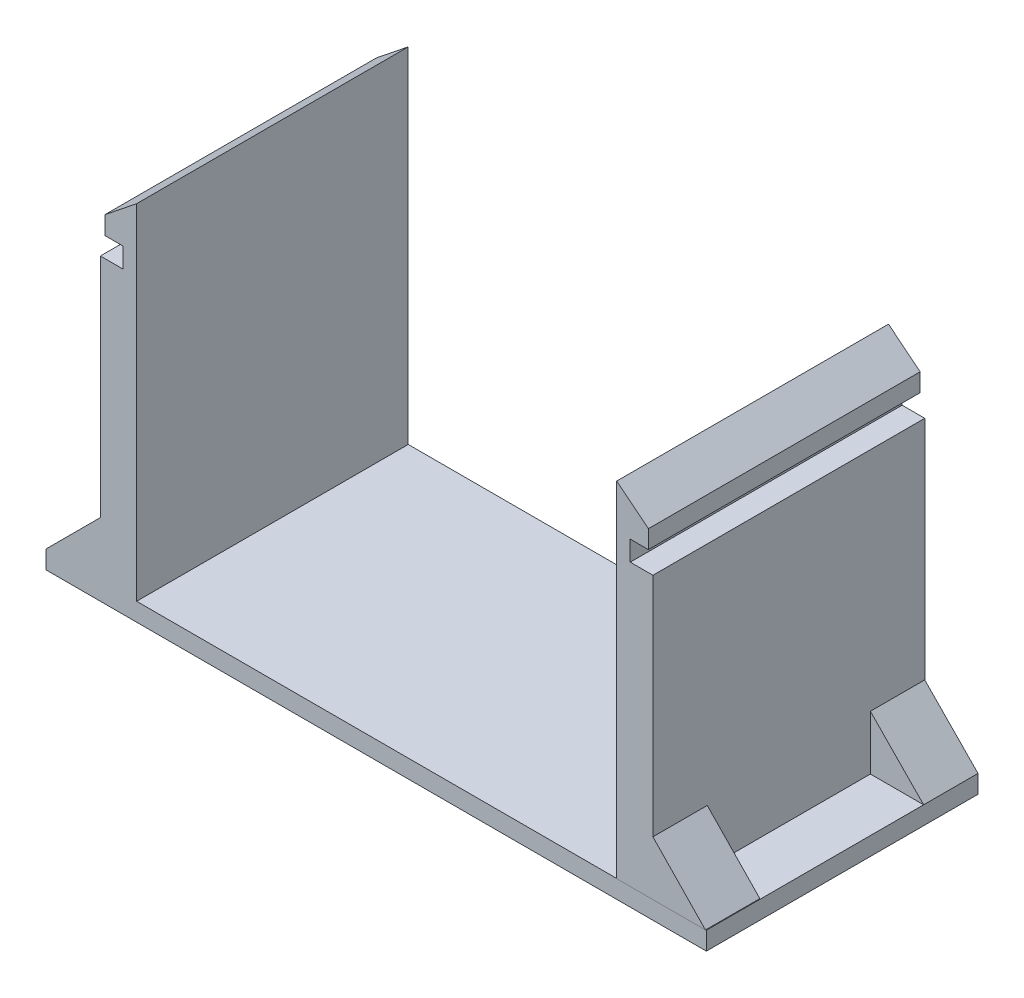
ISO-10303-21;
HEADER;
FILE_DESCRIPTION(('STEP AP214'),'2;1');
FILE_NAME('part.step','',(''),(''),'','','');
FILE_SCHEMA(('AUTOMOTIVE_DESIGN { 1 0 10303 214 1 1 1 1 }'));
ENDSEC;
DATA;
#1=APPLICATION_CONTEXT('core data for automotive mechanical design processes');
#2=APPLICATION_PROTOCOL_DEFINITION('international standard','automotive_design',2000,#1);
#3=PRODUCT_CONTEXT('',#1,'mechanical');
#4=PRODUCT('Part','Part','',(#3));
#5=PRODUCT_RELATED_PRODUCT_CATEGORY('part','',(#4));
#6=PRODUCT_DEFINITION_FORMATION('','',#4);
#7=PRODUCT_DEFINITION_CONTEXT('part definition',#1,'design');
#8=PRODUCT_DEFINITION('design','',#6,#7);
#9=PRODUCT_DEFINITION_SHAPE('','',#8);
#10=(LENGTH_UNIT() NAMED_UNIT(*) SI_UNIT(.MILLI.,.METRE.));
#11=(NAMED_UNIT(*) PLANE_ANGLE_UNIT() SI_UNIT($,.RADIAN.));
#12=(NAMED_UNIT(*) SI_UNIT($,.STERADIAN.) SOLID_ANGLE_UNIT());
#13=UNCERTAINTY_MEASURE_WITH_UNIT(LENGTH_MEASURE(1.E-05),#10,'distance_accuracy_value','');
#14=(GEOMETRIC_REPRESENTATION_CONTEXT(3) GLOBAL_UNCERTAINTY_ASSIGNED_CONTEXT((#13)) GLOBAL_UNIT_ASSIGNED_CONTEXT((#10,
#11,#12)) REPRESENTATION_CONTEXT('',''));
#15=CARTESIAN_POINT('',(0.,0.,0.));
#16=DIRECTION('',(0.,0.,1.));
#17=DIRECTION('',(1.,0.,0.));
#18=AXIS2_PLACEMENT_3D('',#15,#16,#17);
#19=CARTESIAN_POINT('',(0.,0.,0.));
#20=DIRECTION('',(0.,1.,0.));
#21=DIRECTION('',(0.,0.,1.));
#22=AXIS2_PLACEMENT_3D('',#19,#20,#21);
#23=PLANE('',#22);
#24=DIRECTION('',(0.,0.,1.));
#25=VECTOR('',#24,1.);
#26=CARTESIAN_POINT('',(-24.1176439430055,0.,0.));
#27=LINE('',#26,#25);
#28=CARTESIAN_POINT('',(-24.1176439430055,0.,-5.93114042057311));
#29=VERTEX_POINT('',#28);
#30=CARTESIAN_POINT('',(-24.1176439430055,0.,12.0443693212289));
#31=VERTEX_POINT('',#30);
#32=EDGE_CURVE('E393',#29,#31,#27,.T.);
#33=ORIENTED_EDGE('',*,*,#32,.F.);
#34=DIRECTION('',(-1.,0.,0.));
#35=VECTOR('',#34,1.);
#36=CARTESIAN_POINT('',(-24.1176439430055,0.,-5.93114042057311));
#37=LINE('',#36,#35);
#38=CARTESIAN_POINT('',(-30.1176439430055,0.,-5.93114042057311));
#39=VERTEX_POINT('',#38);
#40=EDGE_CURVE('E282',#29,#39,#37,.T.);
#41=ORIENTED_EDGE('',*,*,#40,.T.);
#42=DIRECTION('',(0.,0.,1.));
#43=VECTOR('',#42,1.);
#44=CARTESIAN_POINT('',(-30.1176439430055,0.,18.0443693212289));
#45=LINE('',#44,#43);
#46=CARTESIAN_POINT('',(-30.1176439430055,0.,12.0443693212289));
#47=VERTEX_POINT('',#46);
#48=EDGE_CURVE('E486',#39,#47,#45,.T.);
#49=ORIENTED_EDGE('',*,*,#48,.T.);
#50=DIRECTION('',(1.,0.,0.));
#51=VECTOR('',#50,1.);
#52=CARTESIAN_POINT('',(-30.1176439430055,0.,12.0443693212289));
#53=LINE('',#52,#51);
#54=EDGE_CURVE('E296',#47,#31,#53,.T.);
#55=ORIENTED_EDGE('',*,*,#54,.T.);
#56=EDGE_LOOP('',(#33,#41,#49,#55));
#57=FACE_BOUND('',#56,.T.);
#58=ADVANCED_FACE('F37',(#57),#23,.T.);
#59=DIRECTION('',(0.,0.,-1.));
#60=VECTOR('',#59,1.);
#61=CARTESIAN_POINT('',(42.7586957286419,0.,18.0443693212289));
#62=LINE('',#61,#60);
#63=CARTESIAN_POINT('',(42.7586957286419,0.,18.0443693212289));
#64=VERTEX_POINT('',#63);
#65=CARTESIAN_POINT('',(42.7586957286419,0.,-5.93114042057311));
#66=VERTEX_POINT('',#65);
#67=EDGE_CURVE('E378',#64,#66,#62,.T.);
#68=ORIENTED_EDGE('',*,*,#67,.T.);
#69=DIRECTION('',(-1.,0.,0.));
#70=VECTOR('',#69,1.);
#71=CARTESIAN_POINT('',(36.8823560569945,0.,-5.93114042057311));
#72=LINE('',#71,#70);
#73=CARTESIAN_POINT('',(36.8823560569945,0.,-5.93114042057311));
#74=VERTEX_POINT('',#73);
#75=EDGE_CURVE('E308',#66,#74,#72,.T.);
#76=ORIENTED_EDGE('',*,*,#75,.T.);
#77=DIRECTION('',(0.,0.,1.));
#78=VECTOR('',#77,1.);
#79=CARTESIAN_POINT('',(36.8823560569945,0.,0.));
#80=LINE('',#79,#78);
#81=CARTESIAN_POINT('',(36.8823560569945,0.,12.0688595794269));
#82=VERTEX_POINT('',#81);
#83=EDGE_CURVE('E339',#74,#82,#80,.T.);
#84=ORIENTED_EDGE('',*,*,#83,.T.);
#85=DIRECTION('',(1.,0.,0.));
#86=VECTOR('',#85,1.);
#87=CARTESIAN_POINT('',(36.8823560569945,0.,12.0688595794269));
#88=LINE('',#87,#86);
#89=CARTESIAN_POINT('',(42.6823560569945,0.,12.0688595794269));
#90=VERTEX_POINT('',#89);
#91=EDGE_CURVE('E331',#82,#90,#88,.T.);
#92=ORIENTED_EDGE('',*,*,#91,.T.);
#93=DIRECTION('',(0.,0.,1.));
#94=VECTOR('',#93,1.);
#95=CARTESIAN_POINT('',(42.6823560569945,0.,12.0688595794269));
#96=LINE('',#95,#94);
#97=CARTESIAN_POINT('',(42.6823560569945,0.,18.0443693212289));
#98=VERTEX_POINT('',#97);
#99=EDGE_CURVE('E336',#90,#98,#96,.T.);
#100=ORIENTED_EDGE('',*,*,#99,.T.);
#101=DIRECTION('',(1.,0.,0.));
#102=VECTOR('',#101,1.);
#103=CARTESIAN_POINT('',(-30.1176439430055,0.,18.0443693212289));
#104=LINE('',#103,#102);
#105=EDGE_CURVE('E361',#98,#64,#104,.T.);
#106=ORIENTED_EDGE('',*,*,#105,.T.);
#107=EDGE_LOOP('',(#68,#76,#84,#92,#100,#106));
#108=FACE_BOUND('',#107,.T.);
#109=ADVANCED_FACE('F506',(#108),#23,.T.);
#110=CARTESIAN_POINT('',(-20.1176439430055,0.,18.0443693212289));
#111=VERTEX_POINT('',#110);
#112=CARTESIAN_POINT('',(32.8823560569945,0.,18.0443693212289));
#113=VERTEX_POINT('',#112);
#114=EDGE_CURVE('E383',#111,#113,#104,.T.);
#115=ORIENTED_EDGE('',*,*,#114,.T.);
#116=DIRECTION('',(0.,0.,1.));
#117=VECTOR('',#116,1.);
#118=CARTESIAN_POINT('',(32.8823560569945,0.,0.));
#119=LINE('',#118,#117);
#120=CARTESIAN_POINT('',(32.8823560569945,0.,-11.9311404205731));
#121=VERTEX_POINT('',#120);
#122=EDGE_CURVE('E349',#121,#113,#119,.T.);
#123=ORIENTED_EDGE('',*,*,#122,.F.);
#124=DIRECTION('',(-1.,0.,0.));
#125=VECTOR('',#124,1.);
#126=CARTESIAN_POINT('',(-30.1176439430055,0.,-11.9311404205731));
#127=LINE('',#126,#125);
#128=CARTESIAN_POINT('',(-20.1176439430055,0.,-11.9311404205731));
#129=VERTEX_POINT('',#128);
#130=EDGE_CURVE('E390',#121,#129,#127,.T.);
#131=ORIENTED_EDGE('',*,*,#130,.T.);
#132=DIRECTION('',(0.,0.,1.));
#133=VECTOR('',#132,1.);
#134=CARTESIAN_POINT('',(-20.1176439430055,0.,0.));
#135=LINE('',#134,#133);
#136=EDGE_CURVE('E396',#129,#111,#135,.T.);
#137=ORIENTED_EDGE('',*,*,#136,.T.);
#138=EDGE_LOOP('',(#115,#123,#131,#137));
#139=FACE_BOUND('',#138,.T.);
#140=ADVANCED_FACE('F496',(#139),#23,.T.);
#141=CARTESIAN_POINT('',(-24.1176439430055,38.,0.));
#142=DIRECTION('',(1.,0.,0.));
#143=DIRECTION('',(0.,0.,-1.));
#144=AXIS2_PLACEMENT_3D('',#141,#142,#143);
#145=PLANE('',#144);
#146=DIRECTION('',(0.,-1.,0.));
#147=VECTOR('',#146,1.);
#148=CARTESIAN_POINT('',(-24.1176439430055,38.,18.0443693212289));
#149=LINE('',#148,#147);
#150=CARTESIAN_POINT('',(-24.1176439430055,31.,18.0443693212289));
#151=VERTEX_POINT('',#150);
#152=CARTESIAN_POINT('',(-24.1176439430055,6.,18.0443693212289));
#153=VERTEX_POINT('',#152);
#154=EDGE_CURVE('E408',#151,#153,#149,.T.);
#155=ORIENTED_EDGE('',*,*,#154,.F.);
#156=DIRECTION('',(0.,0.,1.));
#157=VECTOR('',#156,1.);
#158=CARTESIAN_POINT('',(-24.1176439430055,31.,18.0443693212289));
#159=LINE('',#158,#157);
#160=CARTESIAN_POINT('',(-24.1176439430055,31.,-11.9311404205731));
#161=VERTEX_POINT('',#160);
#162=EDGE_CURVE('E236',#161,#151,#159,.T.);
#163=ORIENTED_EDGE('',*,*,#162,.F.);
#164=DIRECTION('',(0.,-1.,0.));
#165=VECTOR('',#164,1.);
#166=CARTESIAN_POINT('',(-24.1176439430055,38.,-11.9311404205731));
#167=LINE('',#166,#165);
#168=CARTESIAN_POINT('',(-24.1176439430055,6.,-11.9311404205731));
#169=VERTEX_POINT('',#168);
#170=EDGE_CURVE('E414',#161,#169,#167,.T.);
#171=ORIENTED_EDGE('',*,*,#170,.T.);
#172=DIRECTION('',(0.,0.,-1.));
#173=VECTOR('',#172,1.);
#174=CARTESIAN_POINT('',(-24.1176439430055,6.,-5.93114042057311));
#175=LINE('',#174,#173);
#176=CARTESIAN_POINT('',(-24.1176439430055,6.,-5.93114042057311));
#177=VERTEX_POINT('',#176);
#178=EDGE_CURVE('E285',#177,#169,#175,.T.);
#179=ORIENTED_EDGE('',*,*,#178,.F.);
#180=DIRECTION('',(0.,-1.,0.));
#181=VECTOR('',#180,1.);
#182=CARTESIAN_POINT('',(-24.1176439430055,6.,-5.93114042057311));
#183=LINE('',#182,#181);
#184=EDGE_CURVE('E280',#177,#29,#183,.T.);
#185=ORIENTED_EDGE('',*,*,#184,.T.);
#186=ORIENTED_EDGE('',*,*,#32,.T.);
#187=DIRECTION('',(0.,1.,0.));
#188=VECTOR('',#187,1.);
#189=CARTESIAN_POINT('',(-24.1176439430055,0.,12.0443693212289));
#190=LINE('',#189,#188);
#191=CARTESIAN_POINT('',(-24.1176439430055,6.,12.0443693212289));
#192=VERTEX_POINT('',#191);
#193=EDGE_CURVE('E291',#31,#192,#190,.T.);
#194=ORIENTED_EDGE('',*,*,#193,.T.);
#195=DIRECTION('',(0.,0.,1.));
#196=VECTOR('',#195,1.);
#197=CARTESIAN_POINT('',(-24.1176439430055,6.,12.0443693212289));
#198=LINE('',#197,#196);
#199=EDGE_CURVE('E299',#192,#153,#198,.T.);
#200=ORIENTED_EDGE('',*,*,#199,.T.);
#201=EDGE_LOOP('',(#155,#163,#171,#179,#185,#186,#194,#200));
#202=FACE_BOUND('',#201,.T.);
#203=ADVANCED_FACE('F39',(#202),#145,.F.);
#204=CARTESIAN_POINT('',(0.,38.,18.0443693212289));
#205=DIRECTION('',(0.,0.,-1.));
#206=DIRECTION('',(-1.,0.,0.));
#207=AXIS2_PLACEMENT_3D('',#204,#205,#206);
#208=PLANE('',#207);
#209=DIRECTION('',(0.,-1.,0.));
#210=VECTOR('',#209,1.);
#211=CARTESIAN_POINT('',(-20.1176439430055,38.,18.0443693212289));
#212=LINE('',#211,#210);
#213=CARTESIAN_POINT('',(-20.1176439430055,38.,18.0443693212289));
#214=VERTEX_POINT('',#213);
#215=EDGE_CURVE('E228',#214,#111,#212,.T.);
#216=ORIENTED_EDGE('',*,*,#215,.F.);
#217=DIRECTION('',(0.780868809443031,0.624695047554424,0.));
#218=VECTOR('',#217,1.);
#219=CARTESIAN_POINT('',(-23.6176439430055,35.2,18.0443693212289));
#220=LINE('',#219,#218);
#221=CARTESIAN_POINT('',(-23.6176439430055,35.2,18.0443693212289));
#222=VERTEX_POINT('',#221);
#223=EDGE_CURVE('E217',#222,#214,#220,.T.);
#224=ORIENTED_EDGE('',*,*,#223,.F.);
#225=DIRECTION('',(0.,1.,0.));
#226=VECTOR('',#225,1.);
#227=CARTESIAN_POINT('',(-23.6176439430055,31.,18.0443693212289));
#228=LINE('',#227,#226);
#229=CARTESIAN_POINT('',(-23.6176439430055,33.2,18.0443693212289));
#230=VERTEX_POINT('',#229);
#231=EDGE_CURVE('E226',#230,#222,#228,.T.);
#232=ORIENTED_EDGE('',*,*,#231,.F.);
#233=DIRECTION('',(-1.,0.,0.));
#234=VECTOR('',#233,1.);
#235=CARTESIAN_POINT('',(-21.6176439430055,33.2,18.0443693212289));
#236=LINE('',#235,#234);
#237=CARTESIAN_POINT('',(-21.6176439430055,33.2,18.0443693212289));
#238=VERTEX_POINT('',#237);
#239=EDGE_CURVE('E445',#238,#230,#236,.T.);
#240=ORIENTED_EDGE('',*,*,#239,.F.);
#241=DIRECTION('',(0.,1.,0.));
#242=VECTOR('',#241,1.);
#243=CARTESIAN_POINT('',(-21.6176439430055,33.2,18.0443693212289));
#244=LINE('',#243,#242);
#245=CARTESIAN_POINT('',(-21.6176439430055,31.,18.0443693212289));
#246=VERTEX_POINT('',#245);
#247=EDGE_CURVE('E443',#246,#238,#244,.T.);
#248=ORIENTED_EDGE('',*,*,#247,.F.);
#249=DIRECTION('',(-1.,0.,0.));
#250=VECTOR('',#249,1.);
#251=CARTESIAN_POINT('',(-23.6176439430055,31.,18.0443693212289));
#252=LINE('',#251,#250);
#253=EDGE_CURVE('E235',#246,#151,#252,.T.);
#254=ORIENTED_EDGE('',*,*,#253,.T.);
#255=ORIENTED_EDGE('',*,*,#154,.T.);
#256=DIRECTION('',(-0.707106781186547,-0.707106781186548,0.));
#257=VECTOR('',#256,1.);
#258=CARTESIAN_POINT('',(-24.1176439430055,6.,18.0443693212289));
#259=LINE('',#258,#257);
#260=CARTESIAN_POINT('',(-30.1176439430055,0.,18.0443693212289));
#261=VERTEX_POINT('',#260);
#262=EDGE_CURVE('E290',#153,#261,#259,.T.);
#263=ORIENTED_EDGE('',*,*,#262,.T.);
#264=DIRECTION('',(0.,1.,0.));
#265=VECTOR('',#264,1.);
#266=CARTESIAN_POINT('',(-30.1176439430055,-2.,18.0443693212289));
#267=LINE('',#266,#265);
#268=CARTESIAN_POINT('',(-30.1176439430055,-2.,18.0443693212289));
#269=VERTEX_POINT('',#268);
#270=EDGE_CURVE('E397',#269,#261,#267,.T.);
#271=ORIENTED_EDGE('',*,*,#270,.F.);
#272=DIRECTION('',(1.,0.,0.));
#273=VECTOR('',#272,1.);
#274=CARTESIAN_POINT('',(-30.1176439430055,-2.,18.0443693212289));
#275=LINE('',#274,#273);
#276=CARTESIAN_POINT('',(42.7586957286419,-2.,18.0443693212289));
#277=VERTEX_POINT('',#276);
#278=EDGE_CURVE('E362',#269,#277,#275,.T.);
#279=ORIENTED_EDGE('',*,*,#278,.T.);
#280=DIRECTION('',(0.,1.,0.));
#281=VECTOR('',#280,1.);
#282=CARTESIAN_POINT('',(42.7586957286419,-2.,18.0443693212289));
#283=LINE('',#282,#281);
#284=EDGE_CURVE('E375',#277,#64,#283,.T.);
#285=ORIENTED_EDGE('',*,*,#284,.T.);
#286=ORIENTED_EDGE('',*,*,#105,.F.);
#287=EDGE_CURVE('E388',#113,#98,#104,.T.);
#288=ORIENTED_EDGE('',*,*,#287,.F.);
#289=ORIENTED_EDGE('',*,*,#114,.F.);
#290=EDGE_LOOP('',(#216,#224,#232,#240,#248,#254,#255,#263,#271,#279,#285,#286,#288,#289));
#291=FACE_BOUND('',#290,.T.);
#292=ADVANCED_FACE('F224',(#291),#208,.F.);
#293=CARTESIAN_POINT('',(-20.1176439430055,38.,0.));
#294=DIRECTION('',(1.,0.,0.));
#295=DIRECTION('',(0.,0.,-1.));
#296=AXIS2_PLACEMENT_3D('',#293,#294,#295);
#297=PLANE('',#296);
#298=ORIENTED_EDGE('',*,*,#136,.F.);
#299=DIRECTION('',(0.,-1.,0.));
#300=VECTOR('',#299,1.);
#301=CARTESIAN_POINT('',(-20.1176439430055,38.,-11.9311404205731));
#302=LINE('',#301,#300);
#303=CARTESIAN_POINT('',(-20.1176439430055,38.,-11.9311404205731));
#304=VERTEX_POINT('',#303);
#305=EDGE_CURVE('E409',#304,#129,#302,.T.);
#306=ORIENTED_EDGE('',*,*,#305,.F.);
#307=DIRECTION('',(0.,0.,1.));
#308=VECTOR('',#307,1.);
#309=CARTESIAN_POINT('',(-20.1176439430055,38.,0.));
#310=LINE('',#309,#308);
#311=EDGE_CURVE('E402',#304,#214,#310,.T.);
#312=ORIENTED_EDGE('',*,*,#311,.T.);
#313=ORIENTED_EDGE('',*,*,#215,.T.);
#314=EDGE_LOOP('',(#298,#306,#312,#313));
#315=FACE_BOUND('',#314,.T.);
#316=ADVANCED_FACE('F530',(#315),#297,.T.);
#317=CARTESIAN_POINT('',(0.,38.,-11.9311404205731));
#318=DIRECTION('',(0.,0.,-1.));
#319=DIRECTION('',(-1.,0.,0.));
#320=AXIS2_PLACEMENT_3D('',#317,#318,#319);
#321=PLANE('',#320);
#322=DIRECTION('',(-0.780868809443031,-0.624695047554424,0.));
#323=VECTOR('',#322,1.);
#324=CARTESIAN_POINT('',(-7.85078788019725,47.8134848502466,-11.9311404205731));
#325=LINE('',#324,#323);
#326=CARTESIAN_POINT('',(-23.6176439430055,35.2,-11.9311404205731));
#327=VERTEX_POINT('',#326);
#328=EDGE_CURVE('E52',#304,#327,#325,.T.);
#329=ORIENTED_EDGE('',*,*,#328,.F.);
#330=ORIENTED_EDGE('',*,*,#305,.T.);
#331=ORIENTED_EDGE('',*,*,#130,.F.);
#332=DIRECTION('',(0.,-1.,0.));
#333=VECTOR('',#332,1.);
#334=CARTESIAN_POINT('',(32.8823560569945,38.,-11.9311404205731));
#335=LINE('',#334,#333);
#336=CARTESIAN_POINT('',(32.8823560569945,38.,-11.9311404205731));
#337=VERTEX_POINT('',#336);
#338=EDGE_CURVE('E357',#337,#121,#335,.T.);
#339=ORIENTED_EDGE('',*,*,#338,.F.);
#340=DIRECTION('',(-0.780868809443028,0.624695047554427,0.));
#341=VECTOR('',#340,1.);
#342=CARTESIAN_POINT('',(12.8321389490711,54.0401736863388,-11.9311404205731));
#343=LINE('',#342,#341);
#344=CARTESIAN_POINT('',(36.3823560569945,35.2,-11.9311404205731));
#345=VERTEX_POINT('',#344);
#346=EDGE_CURVE('E248',#345,#337,#343,.T.);
#347=ORIENTED_EDGE('',*,*,#346,.F.);
#348=DIRECTION('',(0.,1.,0.));
#349=VECTOR('',#348,1.);
#350=CARTESIAN_POINT('',(36.3823560569945,31.,-11.9311404205731));
#351=LINE('',#350,#349);
#352=CARTESIAN_POINT('',(36.3823560569945,33.2,-11.9311404205731));
#353=VERTEX_POINT('',#352);
#354=EDGE_CURVE('E266',#353,#345,#351,.T.);
#355=ORIENTED_EDGE('',*,*,#354,.F.);
#356=DIRECTION('',(1.,0.,0.));
#357=VECTOR('',#356,1.);
#358=CARTESIAN_POINT('',(0.,33.2,-11.9311404205731));
#359=LINE('',#358,#357);
#360=CARTESIAN_POINT('',(34.3823560569945,33.2,-11.9311404205731));
#361=VERTEX_POINT('',#360);
#362=EDGE_CURVE('E261',#361,#353,#359,.T.);
#363=ORIENTED_EDGE('',*,*,#362,.F.);
#364=DIRECTION('',(0.,1.,0.));
#365=VECTOR('',#364,1.);
#366=CARTESIAN_POINT('',(34.3823560569945,38.,-11.9311404205731));
#367=LINE('',#366,#365);
#368=CARTESIAN_POINT('',(34.3823560569945,31.,-11.9311404205731));
#369=VERTEX_POINT('',#368);
#370=EDGE_CURVE('E263',#369,#361,#367,.T.);
#371=ORIENTED_EDGE('',*,*,#370,.F.);
#372=DIRECTION('',(1.,0.,0.));
#373=VECTOR('',#372,1.);
#374=CARTESIAN_POINT('',(36.3823560569945,31.,-11.9311404205731));
#375=LINE('',#374,#373);
#376=CARTESIAN_POINT('',(36.8823560569945,31.,-11.9311404205731));
#377=VERTEX_POINT('',#376);
#378=EDGE_CURVE('E269',#369,#377,#375,.T.);
#379=ORIENTED_EDGE('',*,*,#378,.T.);
#380=DIRECTION('',(0.,-1.,0.));
#381=VECTOR('',#380,1.);
#382=CARTESIAN_POINT('',(36.8823560569945,38.,-11.9311404205731));
#383=LINE('',#382,#381);
#384=CARTESIAN_POINT('',(36.8823560569945,6.,-11.9311404205731));
#385=VERTEX_POINT('',#384);
#386=EDGE_CURVE('E359',#377,#385,#383,.T.);
#387=ORIENTED_EDGE('',*,*,#386,.T.);
#388=DIRECTION('',(0.699706225549067,-0.714430680981632,0.));
#389=VECTOR('',#388,1.);
#390=CARTESIAN_POINT('',(42.7586957286419,0.,-11.9311404205731));
#391=LINE('',#390,#389);
#392=CARTESIAN_POINT('',(42.7586957286419,0.,-11.9311404205731));
#393=VERTEX_POINT('',#392);
#394=EDGE_CURVE('E305',#385,#393,#391,.T.);
#395=ORIENTED_EDGE('',*,*,#394,.T.);
#396=DIRECTION('',(0.,1.,0.));
#397=VECTOR('',#396,1.);
#398=CARTESIAN_POINT('',(42.7586957286419,-2.,-11.9311404205731));
#399=LINE('',#398,#397);
#400=CARTESIAN_POINT('',(42.7586957286419,-2.,-11.9311404205731));
#401=VERTEX_POINT('',#400);
#402=EDGE_CURVE('E475',#401,#393,#399,.T.);
#403=ORIENTED_EDGE('',*,*,#402,.F.);
#404=DIRECTION('',(-1.,0.,0.));
#405=VECTOR('',#404,1.);
#406=CARTESIAN_POINT('',(-30.1176439430055,-2.,-11.9311404205731));
#407=LINE('',#406,#405);
#408=CARTESIAN_POINT('',(-30.1176439430055,-2.,-11.9311404205731));
#409=VERTEX_POINT('',#408);
#410=EDGE_CURVE('E369',#401,#409,#407,.T.);
#411=ORIENTED_EDGE('',*,*,#410,.T.);
#412=DIRECTION('',(0.,1.,0.));
#413=VECTOR('',#412,1.);
#414=CARTESIAN_POINT('',(-30.1176439430055,-2.,-11.9311404205731));
#415=LINE('',#414,#413);
#416=CARTESIAN_POINT('',(-30.1176439430055,0.,-11.9311404205731));
#417=VERTEX_POINT('',#416);
#418=EDGE_CURVE('E464',#409,#417,#415,.T.);
#419=ORIENTED_EDGE('',*,*,#418,.T.);
#420=DIRECTION('',(0.707106781186547,0.707106781186548,0.));
#421=VECTOR('',#420,1.);
#422=CARTESIAN_POINT('',(-30.1176439430055,0.,-11.9311404205731));
#423=LINE('',#422,#421);
#424=EDGE_CURVE('E276',#417,#169,#423,.T.);
#425=ORIENTED_EDGE('',*,*,#424,.T.);
#426=ORIENTED_EDGE('',*,*,#170,.F.);
#427=DIRECTION('',(-1.,0.,0.));
#428=VECTOR('',#427,1.);
#429=CARTESIAN_POINT('',(0.,31.,-11.9311404205731));
#430=LINE('',#429,#428);
#431=CARTESIAN_POINT('',(-21.6176439430055,31.,-11.9311404205731));
#432=VERTEX_POINT('',#431);
#433=EDGE_CURVE('E423',#432,#161,#430,.T.);
#434=ORIENTED_EDGE('',*,*,#433,.F.);
#435=DIRECTION('',(0.,1.,0.));
#436=VECTOR('',#435,1.);
#437=CARTESIAN_POINT('',(-21.6176439430055,38.,-11.9311404205731));
#438=LINE('',#437,#436);
#439=CARTESIAN_POINT('',(-21.6176439430055,33.2,-11.9311404205731));
#440=VERTEX_POINT('',#439);
#441=EDGE_CURVE('E45',#432,#440,#438,.T.);
#442=ORIENTED_EDGE('',*,*,#441,.T.);
#443=DIRECTION('',(1.,0.,0.));
#444=VECTOR('',#443,1.);
#445=CARTESIAN_POINT('',(0.,33.2,-11.9311404205731));
#446=LINE('',#445,#444);
#447=CARTESIAN_POINT('',(-23.6176439430055,33.2,-11.9311404205731));
#448=VERTEX_POINT('',#447);
#449=EDGE_CURVE('E241',#448,#440,#446,.T.);
#450=ORIENTED_EDGE('',*,*,#449,.F.);
#451=DIRECTION('',(0.,-1.,0.));
#452=VECTOR('',#451,1.);
#453=CARTESIAN_POINT('',(-23.6176439430055,38.,-11.9311404205731));
#454=LINE('',#453,#452);
#455=EDGE_CURVE('E239',#327,#448,#454,.T.);
#456=ORIENTED_EDGE('',*,*,#455,.F.);
#457=EDGE_LOOP('',(#329,#330,#331,#339,#347,#355,#363,#371,#379,#387,#395,#403,#411,#419,#425,
#426,#434,#442,#450,#456));
#458=FACE_BOUND('',#457,.T.);
#459=ADVANCED_FACE('F429',(#458),#321,.T.);
#460=CARTESIAN_POINT('',(-30.1176439430055,-2.,18.0443693212289));
#461=DIRECTION('',(-1.,0.,0.));
#462=DIRECTION('',(0.,0.,1.));
#463=AXIS2_PLACEMENT_3D('',#460,#461,#462);
#464=PLANE('',#463);
#465=EDGE_CURVE('E366',#417,#39,#45,.T.);
#466=ORIENTED_EDGE('',*,*,#465,.F.);
#467=ORIENTED_EDGE('',*,*,#418,.F.);
#468=DIRECTION('',(0.,0.,1.));
#469=VECTOR('',#468,1.);
#470=CARTESIAN_POINT('',(-30.1176439430055,-2.,18.0443693212289));
#471=LINE('',#470,#469);
#472=EDGE_CURVE('E372',#409,#269,#471,.T.);
#473=ORIENTED_EDGE('',*,*,#472,.T.);
#474=ORIENTED_EDGE('',*,*,#270,.T.);
#475=DIRECTION('',(0.,0.,1.));
#476=VECTOR('',#475,1.);
#477=CARTESIAN_POINT('',(-30.1176439430055,0.,12.0443693212289));
#478=LINE('',#477,#476);
#479=EDGE_CURVE('E302',#47,#261,#478,.T.);
#480=ORIENTED_EDGE('',*,*,#479,.F.);
#481=ORIENTED_EDGE('',*,*,#48,.F.);
#482=EDGE_LOOP('',(#466,#467,#473,#474,#480,#481));
#483=FACE_BOUND('',#482,.T.);
#484=ADVANCED_FACE('F472',(#483),#464,.T.);
#485=CARTESIAN_POINT('',(42.7586957286419,-2.,18.0443693212289));
#486=DIRECTION('',(1.,0.,0.));
#487=DIRECTION('',(0.,0.,-1.));
#488=AXIS2_PLACEMENT_3D('',#485,#486,#487);
#489=PLANE('',#488);
#490=ORIENTED_EDGE('',*,*,#67,.F.);
#491=ORIENTED_EDGE('',*,*,#284,.F.);
#492=DIRECTION('',(0.,0.,-1.));
#493=VECTOR('',#492,1.);
#494=CARTESIAN_POINT('',(42.7586957286419,-2.,18.0443693212289));
#495=LINE('',#494,#493);
#496=EDGE_CURVE('E365',#277,#401,#495,.T.);
#497=ORIENTED_EDGE('',*,*,#496,.T.);
#498=ORIENTED_EDGE('',*,*,#402,.T.);
#499=DIRECTION('',(0.,0.,-1.));
#500=VECTOR('',#499,1.);
#501=CARTESIAN_POINT('',(42.7586957286419,0.,-5.93114042057311));
#502=LINE('',#501,#500);
#503=EDGE_CURVE('E320',#66,#393,#502,.T.);
#504=ORIENTED_EDGE('',*,*,#503,.F.);
#505=EDGE_LOOP('',(#490,#491,#497,#498,#504));
#506=FACE_BOUND('',#505,.T.);
#507=ADVANCED_FACE('F480',(#506),#489,.T.);
#508=CARTESIAN_POINT('',(0.,-2.,0.));
#509=DIRECTION('',(0.,1.,0.));
#510=DIRECTION('',(0.,0.,1.));
#511=AXIS2_PLACEMENT_3D('',#508,#509,#510);
#512=PLANE('',#511);
#513=ORIENTED_EDGE('',*,*,#278,.F.);
#514=ORIENTED_EDGE('',*,*,#472,.F.);
#515=ORIENTED_EDGE('',*,*,#410,.F.);
#516=ORIENTED_EDGE('',*,*,#496,.F.);
#517=EDGE_LOOP('',(#513,#514,#515,#516));
#518=FACE_BOUND('',#517,.T.);
#519=ADVANCED_FACE('F469',(#518),#512,.F.);
#520=CARTESIAN_POINT('',(0.,0.,0.));
#521=DIRECTION('',(0.,1.,0.));
#522=DIRECTION('',(0.,0.,1.));
#523=AXIS2_PLACEMENT_3D('',#520,#521,#522);
#524=PLANE('',#523);
#525=CARTESIAN_POINT('',(32.8823560569945,0.,18.0688595794269));
#526=VERTEX_POINT('',#525);
#527=EDGE_CURVE('E348',#113,#526,#119,.T.);
#528=ORIENTED_EDGE('',*,*,#527,.F.);
#529=ORIENTED_EDGE('',*,*,#287,.T.);
#530=CARTESIAN_POINT('',(42.6823560569945,0.,18.0688595794269));
#531=VERTEX_POINT('',#530);
#532=EDGE_CURVE('E340',#98,#531,#96,.T.);
#533=ORIENTED_EDGE('',*,*,#532,.T.);
#534=DIRECTION('',(1.,0.,0.));
#535=VECTOR('',#534,1.);
#536=CARTESIAN_POINT('',(0.,0.,18.0688595794269));
#537=LINE('',#536,#535);
#538=EDGE_CURVE('E346',#526,#531,#537,.T.);
#539=ORIENTED_EDGE('',*,*,#538,.F.);
#540=EDGE_LOOP('',(#528,#529,#533,#539));
#541=FACE_BOUND('',#540,.T.);
#542=ADVANCED_FACE('F502',(#541),#524,.F.);
#543=CARTESIAN_POINT('',(36.8823560569945,38.,0.));
#544=DIRECTION('',(1.,0.,0.));
#545=DIRECTION('',(0.,0.,-1.));
#546=AXIS2_PLACEMENT_3D('',#543,#544,#545);
#547=PLANE('',#546);
#548=DIRECTION('',(0.,0.,-1.));
#549=VECTOR('',#548,1.);
#550=CARTESIAN_POINT('',(36.8823560569945,31.,-11.9311404205731));
#551=LINE('',#550,#549);
#552=CARTESIAN_POINT('',(36.8823560569945,31.,18.0688595794269));
#553=VERTEX_POINT('',#552);
#554=EDGE_CURVE('E265',#553,#377,#551,.T.);
#555=ORIENTED_EDGE('',*,*,#554,.F.);
#556=DIRECTION('',(0.,-1.,0.));
#557=VECTOR('',#556,1.);
#558=CARTESIAN_POINT('',(36.8823560569945,38.,18.0688595794269));
#559=LINE('',#558,#557);
#560=CARTESIAN_POINT('',(36.8823560569945,6.,18.0688595794269));
#561=VERTEX_POINT('',#560);
#562=EDGE_CURVE('E345',#553,#561,#559,.T.);
#563=ORIENTED_EDGE('',*,*,#562,.T.);
#564=DIRECTION('',(0.,0.,1.));
#565=VECTOR('',#564,1.);
#566=CARTESIAN_POINT('',(36.8823560569945,6.,12.0688595794269));
#567=LINE('',#566,#565);
#568=CARTESIAN_POINT('',(36.8823560569945,6.,12.0688595794269));
#569=VERTEX_POINT('',#568);
#570=EDGE_CURVE('E333',#569,#561,#567,.T.);
#571=ORIENTED_EDGE('',*,*,#570,.F.);
#572=DIRECTION('',(0.,-1.,0.));
#573=VECTOR('',#572,1.);
#574=CARTESIAN_POINT('',(36.8823560569945,6.,12.0688595794269));
#575=LINE('',#574,#573);
#576=EDGE_CURVE('E328',#569,#82,#575,.T.);
#577=ORIENTED_EDGE('',*,*,#576,.T.);
#578=ORIENTED_EDGE('',*,*,#83,.F.);
#579=DIRECTION('',(0.,1.,0.));
#580=VECTOR('',#579,1.);
#581=CARTESIAN_POINT('',(36.8823560569945,6.,-5.93114042057311));
#582=LINE('',#581,#580);
#583=CARTESIAN_POINT('',(36.8823560569945,6.,-5.93114042057311));
#584=VERTEX_POINT('',#583);
#585=EDGE_CURVE('E311',#74,#584,#582,.T.);
#586=ORIENTED_EDGE('',*,*,#585,.T.);
#587=DIRECTION('',(0.,0.,-1.));
#588=VECTOR('',#587,1.);
#589=CARTESIAN_POINT('',(36.8823560569945,6.,-5.93114042057311));
#590=LINE('',#589,#588);
#591=EDGE_CURVE('E317',#584,#385,#590,.T.);
#592=ORIENTED_EDGE('',*,*,#591,.T.);
#593=ORIENTED_EDGE('',*,*,#386,.F.);
#594=EDGE_LOOP('',(#555,#563,#571,#577,#578,#586,#592,#593));
#595=FACE_BOUND('',#594,.T.);
#596=ADVANCED_FACE('F517',(#595),#547,.T.);
#597=CARTESIAN_POINT('',(32.8823560569945,38.,0.));
#598=DIRECTION('',(1.,0.,0.));
#599=DIRECTION('',(0.,0.,-1.));
#600=AXIS2_PLACEMENT_3D('',#597,#598,#599);
#601=PLANE('',#600);
#602=ORIENTED_EDGE('',*,*,#122,.T.);
#603=ORIENTED_EDGE('',*,*,#527,.T.);
#604=DIRECTION('',(0.,-1.,0.));
#605=VECTOR('',#604,1.);
#606=CARTESIAN_POINT('',(32.8823560569945,38.,18.0688595794269));
#607=LINE('',#606,#605);
#608=CARTESIAN_POINT('',(32.8823560569945,38.,18.0688595794269));
#609=VERTEX_POINT('',#608);
#610=EDGE_CURVE('E354',#609,#526,#607,.T.);
#611=ORIENTED_EDGE('',*,*,#610,.F.);
#612=DIRECTION('',(0.,0.,1.));
#613=VECTOR('',#612,1.);
#614=CARTESIAN_POINT('',(32.8823560569945,38.,0.));
#615=LINE('',#614,#613);
#616=EDGE_CURVE('E343',#337,#609,#615,.T.);
#617=ORIENTED_EDGE('',*,*,#616,.F.);
#618=ORIENTED_EDGE('',*,*,#338,.T.);
#619=EDGE_LOOP('',(#602,#603,#611,#617,#618));
#620=FACE_BOUND('',#619,.T.);
#621=ADVANCED_FACE('F524',(#620),#601,.F.);
#622=CARTESIAN_POINT('',(0.,38.,18.0688595794269));
#623=DIRECTION('',(0.,0.,-1.));
#624=DIRECTION('',(-1.,0.,0.));
#625=AXIS2_PLACEMENT_3D('',#622,#623,#624);
#626=PLANE('',#625);
#627=DIRECTION('',(0.,1.,0.));
#628=VECTOR('',#627,1.);
#629=CARTESIAN_POINT('',(36.3823560569945,38.,18.0688595794269));
#630=LINE('',#629,#628);
#631=CARTESIAN_POINT('',(36.3823560569945,33.2,18.0688595794269));
#632=VERTEX_POINT('',#631);
#633=CARTESIAN_POINT('',(36.3823560569945,35.2,18.0688595794269));
#634=VERTEX_POINT('',#633);
#635=EDGE_CURVE('E273',#632,#634,#630,.T.);
#636=ORIENTED_EDGE('',*,*,#635,.T.);
#637=DIRECTION('',(0.780868809443028,-0.624695047554427,0.));
#638=VECTOR('',#637,1.);
#639=CARTESIAN_POINT('',(36.3823560569945,35.2,18.0688595794269));
#640=LINE('',#639,#638);
#641=EDGE_CURVE('E59',#609,#634,#640,.T.);
#642=ORIENTED_EDGE('',*,*,#641,.F.);
#643=ORIENTED_EDGE('',*,*,#610,.T.);
#644=ORIENTED_EDGE('',*,*,#538,.T.);
#645=DIRECTION('',(-0.695022096847473,0.718988376049114,0.));
#646=VECTOR('',#645,1.);
#647=CARTESIAN_POINT('',(42.6823560569945,0.,18.0688595794269));
#648=LINE('',#647,#646);
#649=EDGE_CURVE('E322',#531,#561,#648,.T.);
#650=ORIENTED_EDGE('',*,*,#649,.T.);
#651=ORIENTED_EDGE('',*,*,#562,.F.);
#652=DIRECTION('',(-1.,0.,0.));
#653=VECTOR('',#652,1.);
#654=CARTESIAN_POINT('',(0.,31.,18.0688595794269));
#655=LINE('',#654,#653);
#656=CARTESIAN_POINT('',(34.3823560569945,31.,18.0688595794269));
#657=VERTEX_POINT('',#656);
#658=EDGE_CURVE('E398',#553,#657,#655,.T.);
#659=ORIENTED_EDGE('',*,*,#658,.T.);
#660=DIRECTION('',(0.,-1.,0.));
#661=VECTOR('',#660,1.);
#662=CARTESIAN_POINT('',(34.3823560569945,33.2,18.0688595794269));
#663=LINE('',#662,#661);
#664=CARTESIAN_POINT('',(34.3823560569945,33.2,18.0688595794269));
#665=VERTEX_POINT('',#664);
#666=EDGE_CURVE('E252',#665,#657,#663,.T.);
#667=ORIENTED_EDGE('',*,*,#666,.F.);
#668=DIRECTION('',(1.,0.,0.));
#669=VECTOR('',#668,1.);
#670=CARTESIAN_POINT('',(34.3823560569945,33.2,18.0688595794269));
#671=LINE('',#670,#669);
#672=EDGE_CURVE('E258',#665,#632,#671,.T.);
#673=ORIENTED_EDGE('',*,*,#672,.T.);
#674=EDGE_LOOP('',(#636,#642,#643,#644,#650,#651,#659,#667,#673));
#675=FACE_BOUND('',#674,.T.);
#676=ADVANCED_FACE('F520',(#675),#626,.F.);
#677=CARTESIAN_POINT('',(42.6823560569945,0.,12.0688595794269));
#678=DIRECTION('',(0.718988376049114,0.695022096847473,0.));
#679=DIRECTION('',(-0.695022096847473,0.718988376049114,0.));
#680=AXIS2_PLACEMENT_3D('',#677,#678,#679);
#681=PLANE('',#680);
#682=ORIENTED_EDGE('',*,*,#649,.F.);
#683=ORIENTED_EDGE('',*,*,#532,.F.);
#684=ORIENTED_EDGE('',*,*,#99,.F.);
#685=DIRECTION('',(-0.695022096847473,0.718988376049114,0.));
#686=VECTOR('',#685,1.);
#687=CARTESIAN_POINT('',(42.6823560569945,0.,12.0688595794269));
#688=LINE('',#687,#686);
#689=EDGE_CURVE('E325',#90,#569,#688,.T.);
#690=ORIENTED_EDGE('',*,*,#689,.T.);
#691=ORIENTED_EDGE('',*,*,#570,.T.);
#692=EDGE_LOOP('',(#682,#683,#684,#690,#691));
#693=FACE_BOUND('',#692,.T.);
#694=ADVANCED_FACE('F510',(#693),#681,.T.);
#695=CARTESIAN_POINT('',(0.,0.,12.0688595794269));
#696=DIRECTION('',(0.,0.,-1.));
#697=DIRECTION('',(-1.,0.,0.));
#698=AXIS2_PLACEMENT_3D('',#695,#696,#697);
#699=PLANE('',#698);
#700=ORIENTED_EDGE('',*,*,#689,.F.);
#701=ORIENTED_EDGE('',*,*,#91,.F.);
#702=ORIENTED_EDGE('',*,*,#576,.F.);
#703=EDGE_LOOP('',(#700,#701,#702));
#704=FACE_BOUND('',#703,.T.);
#705=ADVANCED_FACE('F513',(#704),#699,.T.);
#706=CARTESIAN_POINT('',(42.7586957286419,0.,-5.93114042057311));
#707=DIRECTION('',(0.714430680981631,0.699706225549067,0.));
#708=DIRECTION('',(-0.699706225549067,0.714430680981632,0.));
#709=AXIS2_PLACEMENT_3D('',#706,#707,#708);
#710=PLANE('',#709);
#711=ORIENTED_EDGE('',*,*,#394,.F.);
#712=ORIENTED_EDGE('',*,*,#591,.F.);
#713=DIRECTION('',(0.699706225549067,-0.714430680981632,0.));
#714=VECTOR('',#713,1.);
#715=CARTESIAN_POINT('',(42.7586957286419,0.,-5.93114042057311));
#716=LINE('',#715,#714);
#717=EDGE_CURVE('E314',#584,#66,#716,.T.);
#718=ORIENTED_EDGE('',*,*,#717,.T.);
#719=ORIENTED_EDGE('',*,*,#503,.T.);
#720=EDGE_LOOP('',(#711,#712,#718,#719));
#721=FACE_BOUND('',#720,.T.);
#722=ADVANCED_FACE('F693',(#721),#710,.T.);
#723=CARTESIAN_POINT('',(0.,0.,-5.93114042057311));
#724=DIRECTION('',(0.,0.,-1.));
#725=DIRECTION('',(-1.,0.,0.));
#726=AXIS2_PLACEMENT_3D('',#723,#724,#725);
#727=PLANE('',#726);
#728=ORIENTED_EDGE('',*,*,#75,.F.);
#729=ORIENTED_EDGE('',*,*,#717,.F.);
#730=ORIENTED_EDGE('',*,*,#585,.F.);
#731=EDGE_LOOP('',(#728,#729,#730));
#732=FACE_BOUND('',#731,.T.);
#733=ADVANCED_FACE('F687',(#732),#727,.F.);
#734=CARTESIAN_POINT('',(-24.1176439430055,6.,12.0443693212289));
#735=DIRECTION('',(-0.707106781186548,0.707106781186547,0.));
#736=DIRECTION('',(-0.707106781186547,-0.707106781186548,0.));
#737=AXIS2_PLACEMENT_3D('',#734,#735,#736);
#738=PLANE('',#737);
#739=ORIENTED_EDGE('',*,*,#262,.F.);
#740=ORIENTED_EDGE('',*,*,#199,.F.);
#741=DIRECTION('',(-0.707106781186547,-0.707106781186548,0.));
#742=VECTOR('',#741,1.);
#743=CARTESIAN_POINT('',(-24.1176439430055,6.,12.0443693212289));
#744=LINE('',#743,#742);
#745=EDGE_CURVE('E293',#192,#47,#744,.T.);
#746=ORIENTED_EDGE('',*,*,#745,.T.);
#747=ORIENTED_EDGE('',*,*,#479,.T.);
#748=EDGE_LOOP('',(#739,#740,#746,#747));
#749=FACE_BOUND('',#748,.T.);
#750=ADVANCED_FACE('F459',(#749),#738,.T.);
#751=CARTESIAN_POINT('',(0.,0.,12.0443693212289));
#752=DIRECTION('',(0.,0.,-1.));
#753=DIRECTION('',(-1.,0.,0.));
#754=AXIS2_PLACEMENT_3D('',#751,#752,#753);
#755=PLANE('',#754);
#756=ORIENTED_EDGE('',*,*,#193,.F.);
#757=ORIENTED_EDGE('',*,*,#54,.F.);
#758=ORIENTED_EDGE('',*,*,#745,.F.);
#759=EDGE_LOOP('',(#756,#757,#758));
#760=FACE_BOUND('',#759,.T.);
#761=ADVANCED_FACE('F673',(#760),#755,.T.);
#762=CARTESIAN_POINT('',(-30.1176439430055,0.,-5.93114042057311));
#763=DIRECTION('',(-0.707106781186548,0.707106781186547,0.));
#764=DIRECTION('',(-0.707106781186547,-0.707106781186548,0.));
#765=AXIS2_PLACEMENT_3D('',#762,#763,#764);
#766=PLANE('',#765);
#767=ORIENTED_EDGE('',*,*,#424,.F.);
#768=ORIENTED_EDGE('',*,*,#465,.T.);
#769=DIRECTION('',(0.707106781186547,0.707106781186548,0.));
#770=VECTOR('',#769,1.);
#771=CARTESIAN_POINT('',(-30.1176439430055,0.,-5.93114042057311));
#772=LINE('',#771,#770);
#773=EDGE_CURVE('E277',#39,#177,#772,.T.);
#774=ORIENTED_EDGE('',*,*,#773,.T.);
#775=ORIENTED_EDGE('',*,*,#178,.T.);
#776=EDGE_LOOP('',(#767,#768,#774,#775));
#777=FACE_BOUND('',#776,.T.);
#778=ADVANCED_FACE('F665',(#777),#766,.T.);
#779=CARTESIAN_POINT('',(0.,0.,-5.93114042057311));
#780=DIRECTION('',(0.,0.,-1.));
#781=DIRECTION('',(-1.,0.,0.));
#782=AXIS2_PLACEMENT_3D('',#779,#780,#781);
#783=PLANE('',#782);
#784=ORIENTED_EDGE('',*,*,#773,.F.);
#785=ORIENTED_EDGE('',*,*,#40,.F.);
#786=ORIENTED_EDGE('',*,*,#184,.F.);
#787=EDGE_LOOP('',(#784,#785,#786));
#788=FACE_BOUND('',#787,.T.);
#789=ADVANCED_FACE('F656',(#788),#783,.F.);
#790=CARTESIAN_POINT('',(36.3823560569945,31.,-11.9311404205731));
#791=DIRECTION('',(0.,-1.,0.));
#792=DIRECTION('',(0.,0.,-1.));
#793=AXIS2_PLACEMENT_3D('',#790,#791,#792);
#794=PLANE('',#793);
#795=ORIENTED_EDGE('',*,*,#554,.T.);
#796=ORIENTED_EDGE('',*,*,#378,.F.);
#797=DIRECTION('',(0.,0.,-1.));
#798=VECTOR('',#797,1.);
#799=CARTESIAN_POINT('',(34.3823560569945,31.,18.0688595794269));
#800=LINE('',#799,#798);
#801=EDGE_CURVE('E255',#657,#369,#800,.T.);
#802=ORIENTED_EDGE('',*,*,#801,.F.);
#803=ORIENTED_EDGE('',*,*,#658,.F.);
#804=EDGE_LOOP('',(#795,#796,#802,#803));
#805=FACE_BOUND('',#804,.T.);
#806=ADVANCED_FACE('F648',(#805),#794,.F.);
#807=CARTESIAN_POINT('',(36.3823560569945,0.,0.));
#808=DIRECTION('',(-1.,0.,0.));
#809=DIRECTION('',(0.,0.,1.));
#810=AXIS2_PLACEMENT_3D('',#807,#808,#809);
#811=PLANE('',#810);
#812=ORIENTED_EDGE('',*,*,#354,.T.);
#813=DIRECTION('',(0.,0.,1.));
#814=VECTOR('',#813,1.);
#815=CARTESIAN_POINT('',(36.3823560569945,35.2,0.));
#816=LINE('',#815,#814);
#817=EDGE_CURVE('E422',#345,#634,#816,.T.);
#818=ORIENTED_EDGE('',*,*,#817,.T.);
#819=ORIENTED_EDGE('',*,*,#635,.F.);
#820=DIRECTION('',(0.,0.,-1.));
#821=VECTOR('',#820,1.);
#822=CARTESIAN_POINT('',(36.3823560569945,33.2,0.));
#823=LINE('',#822,#821);
#824=EDGE_CURVE('E830',#632,#353,#823,.T.);
#825=ORIENTED_EDGE('',*,*,#824,.T.);
#826=EDGE_LOOP('',(#812,#818,#819,#825));
#827=FACE_BOUND('',#826,.T.);
#828=ADVANCED_FACE('F640',(#827),#811,.F.);
#829=CARTESIAN_POINT('',(34.3823560569945,33.2,18.0688595794269));
#830=DIRECTION('',(0.,1.,0.));
#831=DIRECTION('',(0.,0.,1.));
#832=AXIS2_PLACEMENT_3D('',#829,#830,#831);
#833=PLANE('',#832);
#834=ORIENTED_EDGE('',*,*,#362,.T.);
#835=ORIENTED_EDGE('',*,*,#824,.F.);
#836=ORIENTED_EDGE('',*,*,#672,.F.);
#837=DIRECTION('',(0.,0.,1.));
#838=VECTOR('',#837,1.);
#839=CARTESIAN_POINT('',(34.3823560569945,33.2,18.0688595794269));
#840=LINE('',#839,#838);
#841=EDGE_CURVE('E250',#361,#665,#840,.T.);
#842=ORIENTED_EDGE('',*,*,#841,.F.);
#843=EDGE_LOOP('',(#834,#835,#836,#842));
#844=FACE_BOUND('',#843,.T.);
#845=ADVANCED_FACE('F631',(#844),#833,.F.);
#846=CARTESIAN_POINT('',(34.3823560569945,0.,0.));
#847=DIRECTION('',(-1.,0.,0.));
#848=DIRECTION('',(0.,0.,1.));
#849=AXIS2_PLACEMENT_3D('',#846,#847,#848);
#850=PLANE('',#849);
#851=ORIENTED_EDGE('',*,*,#370,.T.);
#852=ORIENTED_EDGE('',*,*,#841,.T.);
#853=ORIENTED_EDGE('',*,*,#666,.T.);
#854=ORIENTED_EDGE('',*,*,#801,.T.);
#855=EDGE_LOOP('',(#851,#852,#853,#854));
#856=FACE_BOUND('',#855,.T.);
#857=ADVANCED_FACE('F623',(#856),#850,.F.);
#858=CARTESIAN_POINT('',(36.3823560569945,35.2,-11.9311904205731));
#859=DIRECTION('',(-0.624695047554427,-0.780868809443028,0.));
#860=DIRECTION('',(0.780868809443028,-0.624695047554427,0.));
#861=AXIS2_PLACEMENT_3D('',#858,#859,#860);
#862=PLANE('',#861);
#863=ORIENTED_EDGE('',*,*,#346,.T.);
#864=ORIENTED_EDGE('',*,*,#616,.T.);
#865=ORIENTED_EDGE('',*,*,#641,.T.);
#866=ORIENTED_EDGE('',*,*,#817,.F.);
#867=EDGE_LOOP('',(#863,#864,#865,#866));
#868=FACE_BOUND('',#867,.T.);
#869=ADVANCED_FACE('F615',(#868),#862,.F.);
#870=CARTESIAN_POINT('',(-23.6176439430055,31.,18.0443693212289));
#871=DIRECTION('',(0.,-1.,0.));
#872=DIRECTION('',(0.,0.,-1.));
#873=AXIS2_PLACEMENT_3D('',#870,#871,#872);
#874=PLANE('',#873);
#875=ORIENTED_EDGE('',*,*,#433,.T.);
#876=ORIENTED_EDGE('',*,*,#162,.T.);
#877=ORIENTED_EDGE('',*,*,#253,.F.);
#878=DIRECTION('',(0.,0.,1.));
#879=VECTOR('',#878,1.);
#880=CARTESIAN_POINT('',(-21.6176439430055,31.,18.0443693212289));
#881=LINE('',#880,#879);
#882=EDGE_CURVE('E437',#432,#246,#881,.T.);
#883=ORIENTED_EDGE('',*,*,#882,.F.);
#884=EDGE_LOOP('',(#875,#876,#877,#883));
#885=FACE_BOUND('',#884,.T.);
#886=ADVANCED_FACE('F441',(#885),#874,.F.);
#887=CARTESIAN_POINT('',(-23.6176439430055,0.,0.));
#888=DIRECTION('',(1.,0.,0.));
#889=DIRECTION('',(0.,0.,-1.));
#890=AXIS2_PLACEMENT_3D('',#887,#888,#889);
#891=PLANE('',#890);
#892=ORIENTED_EDGE('',*,*,#231,.T.);
#893=DIRECTION('',(0.,0.,-1.));
#894=VECTOR('',#893,1.);
#895=CARTESIAN_POINT('',(-23.6176439430055,35.2,0.));
#896=LINE('',#895,#894);
#897=EDGE_CURVE('E11',#222,#327,#896,.T.);
#898=ORIENTED_EDGE('',*,*,#897,.T.);
#899=ORIENTED_EDGE('',*,*,#455,.T.);
#900=DIRECTION('',(0.,0.,-1.));
#901=VECTOR('',#900,1.);
#902=CARTESIAN_POINT('',(-23.6176439430055,33.2,18.0443693212289));
#903=LINE('',#902,#901);
#904=EDGE_CURVE('E234',#230,#448,#903,.T.);
#905=ORIENTED_EDGE('',*,*,#904,.F.);
#906=EDGE_LOOP('',(#892,#898,#899,#905));
#907=FACE_BOUND('',#906,.T.);
#908=ADVANCED_FACE('F232',(#907),#891,.F.);
#909=CARTESIAN_POINT('',(-21.6176439430055,33.2,18.0443693212289));
#910=DIRECTION('',(0.,1.,0.));
#911=DIRECTION('',(0.,0.,1.));
#912=AXIS2_PLACEMENT_3D('',#909,#910,#911);
#913=PLANE('',#912);
#914=ORIENTED_EDGE('',*,*,#449,.T.);
#915=DIRECTION('',(0.,0.,-1.));
#916=VECTOR('',#915,1.);
#917=CARTESIAN_POINT('',(-21.6176439430055,33.2,18.0443693212289));
#918=LINE('',#917,#916);
#919=EDGE_CURVE('E439',#238,#440,#918,.T.);
#920=ORIENTED_EDGE('',*,*,#919,.F.);
#921=ORIENTED_EDGE('',*,*,#239,.T.);
#922=ORIENTED_EDGE('',*,*,#904,.T.);
#923=EDGE_LOOP('',(#914,#920,#921,#922));
#924=FACE_BOUND('',#923,.T.);
#925=ADVANCED_FACE('F451',(#924),#913,.F.);
#926=CARTESIAN_POINT('',(-21.6176439430055,0.,0.));
#927=DIRECTION('',(-1.,0.,0.));
#928=DIRECTION('',(0.,0.,1.));
#929=AXIS2_PLACEMENT_3D('',#926,#927,#928);
#930=PLANE('',#929);
#931=ORIENTED_EDGE('',*,*,#882,.T.);
#932=ORIENTED_EDGE('',*,*,#247,.T.);
#933=ORIENTED_EDGE('',*,*,#919,.T.);
#934=ORIENTED_EDGE('',*,*,#441,.F.);
#935=EDGE_LOOP('',(#931,#932,#933,#934));
#936=FACE_BOUND('',#935,.T.);
#937=ADVANCED_FACE('F435',(#936),#930,.T.);
#938=CARTESIAN_POINT('',(-23.6176439430055,35.2,-11.9311904205731));
#939=DIRECTION('',(0.624695047554424,-0.780868809443031,0.));
#940=DIRECTION('',(0.780868809443031,0.624695047554424,0.));
#941=AXIS2_PLACEMENT_3D('',#938,#939,#940);
#942=PLANE('',#941);
#943=ORIENTED_EDGE('',*,*,#328,.T.);
#944=ORIENTED_EDGE('',*,*,#897,.F.);
#945=ORIENTED_EDGE('',*,*,#223,.T.);
#946=ORIENTED_EDGE('',*,*,#311,.F.);
#947=EDGE_LOOP('',(#943,#944,#945,#946));
#948=FACE_BOUND('',#947,.T.);
#949=ADVANCED_FACE('F216',(#948),#942,.F.);
#950=CLOSED_SHELL('',(#58,#109,#140,#203,#292,#316,#459,#484,#507,#519,#542,#596,#621,#676,#694,
#705,#722,#733,#750,#761,#778,#789,#806,#828,#845,#857,#869,#886,#908,#925,#937,#949));
#951=MANIFOLD_SOLID_BREP('B2',#950);
#952=ADVANCED_BREP_SHAPE_REPRESENTATION('',(#18,#951),#14);
#953=SHAPE_DEFINITION_REPRESENTATION(#9,#952);
ENDSEC;
END-ISO-10303-21;
